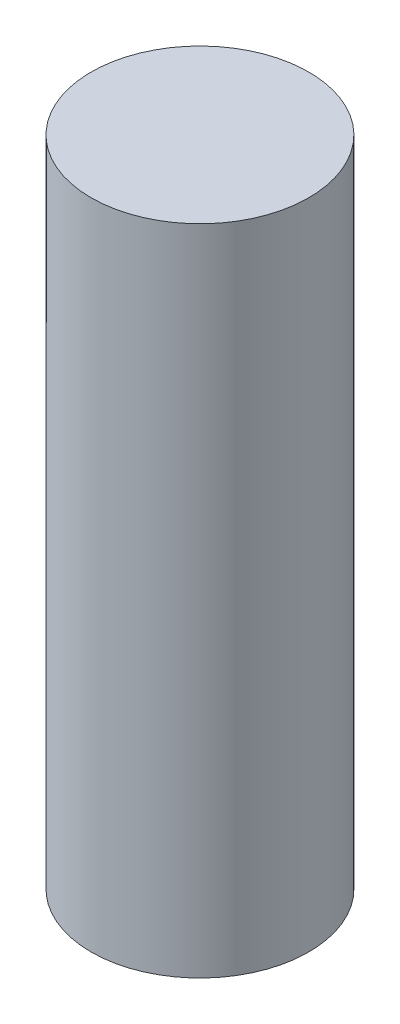
ISO-10303-21;
HEADER;
FILE_DESCRIPTION(('STEP AP214'),'2;1');
FILE_NAME('part.step','',(''),(''),'','','');
FILE_SCHEMA(('AUTOMOTIVE_DESIGN { 1 0 10303 214 1 1 1 1 }'));
ENDSEC;
DATA;
#1=APPLICATION_CONTEXT('core data for automotive mechanical design processes');
#2=APPLICATION_PROTOCOL_DEFINITION('international standard','automotive_design',2000,#1);
#3=PRODUCT_CONTEXT('',#1,'mechanical');
#4=PRODUCT('Part','Part','',(#3));
#5=PRODUCT_RELATED_PRODUCT_CATEGORY('part','',(#4));
#6=PRODUCT_DEFINITION_FORMATION('','',#4);
#7=PRODUCT_DEFINITION_CONTEXT('part definition',#1,'design');
#8=PRODUCT_DEFINITION('design','',#6,#7);
#9=PRODUCT_DEFINITION_SHAPE('','',#8);
#10=(LENGTH_UNIT() NAMED_UNIT(*) SI_UNIT(.MILLI.,.METRE.));
#11=(NAMED_UNIT(*) PLANE_ANGLE_UNIT() SI_UNIT($,.RADIAN.));
#12=(NAMED_UNIT(*) SI_UNIT($,.STERADIAN.) SOLID_ANGLE_UNIT());
#13=UNCERTAINTY_MEASURE_WITH_UNIT(LENGTH_MEASURE(1.E-05),#10,'distance_accuracy_value','');
#14=(GEOMETRIC_REPRESENTATION_CONTEXT(3) GLOBAL_UNCERTAINTY_ASSIGNED_CONTEXT((#13)) GLOBAL_UNIT_ASSIGNED_CONTEXT((#10,
#11,#12)) REPRESENTATION_CONTEXT('',''));
#15=CARTESIAN_POINT('',(0.,0.,0.));
#16=DIRECTION('',(0.,0.,1.));
#17=DIRECTION('',(1.,0.,0.));
#18=AXIS2_PLACEMENT_3D('',#15,#16,#17);
#19=CARTESIAN_POINT('',(0.,60.,0.));
#20=DIRECTION('',(0.,-1.,0.));
#21=DIRECTION('',(0.,0.,-1.));
#22=AXIS2_PLACEMENT_3D('',#19,#20,#21);
#23=CYLINDRICAL_SURFACE('',#22,10.);
#24=CARTESIAN_POINT('',(0.,60.,0.));
#25=DIRECTION('',(0.,1.,0.));
#26=DIRECTION('',(0.,0.,1.));
#27=AXIS2_PLACEMENT_3D('',#24,#25,#26);
#28=CIRCLE('',#27,10.);
#29=CARTESIAN_POINT('',(0.,60.,10.));
#30=VERTEX_POINT('',#29);
#31=EDGE_CURVE('E10',#30,#30,#28,.T.);
#32=ORIENTED_EDGE('',*,*,#31,.F.);
#33=EDGE_LOOP('',(#32));
#34=FACE_BOUND('',#33,.T.);
#35=CARTESIAN_POINT('',(0.,0.,0.));
#36=DIRECTION('',(0.,1.,0.));
#37=DIRECTION('',(0.,0.,1.));
#38=AXIS2_PLACEMENT_3D('',#35,#36,#37);
#39=CIRCLE('',#38,10.);
#40=CARTESIAN_POINT('',(0.,0.,10.));
#41=VERTEX_POINT('',#40);
#42=EDGE_CURVE('E35',#41,#41,#39,.T.);
#43=ORIENTED_EDGE('',*,*,#42,.T.);
#44=EDGE_LOOP('',(#43));
#45=FACE_BOUND('',#44,.T.);
#46=ADVANCED_FACE('F32',(#34,#45),#23,.T.);
#47=CARTESIAN_POINT('',(0.,60.,0.));
#48=DIRECTION('',(0.,1.,0.));
#49=DIRECTION('',(0.,0.,1.));
#50=AXIS2_PLACEMENT_3D('',#47,#48,#49);
#51=PLANE('',#50);
#52=ORIENTED_EDGE('',*,*,#31,.T.);
#53=EDGE_LOOP('',(#52));
#54=FACE_BOUND('',#53,.T.);
#55=ADVANCED_FACE('F47',(#54),#51,.T.);
#56=CARTESIAN_POINT('',(0.,0.,0.));
#57=DIRECTION('',(0.,1.,0.));
#58=DIRECTION('',(0.,0.,1.));
#59=AXIS2_PLACEMENT_3D('',#56,#57,#58);
#60=PLANE('',#59);
#61=ORIENTED_EDGE('',*,*,#42,.F.);
#62=EDGE_LOOP('',(#61));
#63=FACE_BOUND('',#62,.T.);
#64=ADVANCED_FACE('F45',(#63),#60,.F.);
#65=CLOSED_SHELL('',(#46,#55,#64));
#66=MANIFOLD_SOLID_BREP('B2',#65);
#67=ADVANCED_BREP_SHAPE_REPRESENTATION('',(#18,#66),#14);
#68=SHAPE_DEFINITION_REPRESENTATION(#9,#67);
ENDSEC;
END-ISO-10303-21;
